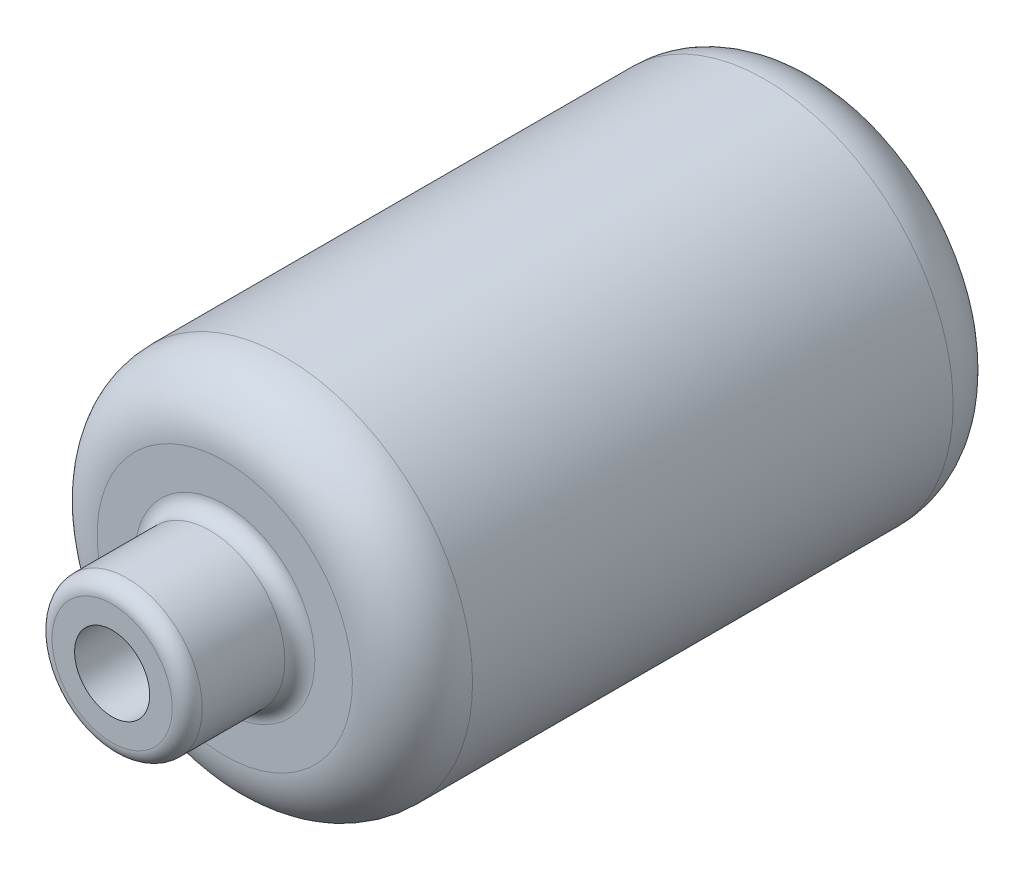
ISO-10303-21;
HEADER;
FILE_DESCRIPTION(('STEP AP214'),'2;1');
FILE_NAME('part.step','',(''),(''),'','','');
FILE_SCHEMA(('AUTOMOTIVE_DESIGN { 1 0 10303 214 1 1 1 1 }'));
ENDSEC;
DATA;
#1=APPLICATION_CONTEXT('core data for automotive mechanical design processes');
#2=APPLICATION_PROTOCOL_DEFINITION('international standard','automotive_design',2000,#1);
#3=PRODUCT_CONTEXT('',#1,'mechanical');
#4=PRODUCT('Part','Part','',(#3));
#5=PRODUCT_RELATED_PRODUCT_CATEGORY('part','',(#4));
#6=PRODUCT_DEFINITION_FORMATION('','',#4);
#7=PRODUCT_DEFINITION_CONTEXT('part definition',#1,'design');
#8=PRODUCT_DEFINITION('design','',#6,#7);
#9=PRODUCT_DEFINITION_SHAPE('','',#8);
#10=(LENGTH_UNIT() NAMED_UNIT(*) SI_UNIT(.MILLI.,.METRE.));
#11=(NAMED_UNIT(*) PLANE_ANGLE_UNIT() SI_UNIT($,.RADIAN.));
#12=(NAMED_UNIT(*) SI_UNIT($,.STERADIAN.) SOLID_ANGLE_UNIT());
#13=UNCERTAINTY_MEASURE_WITH_UNIT(LENGTH_MEASURE(1.E-05),#10,'distance_accuracy_value','');
#14=(GEOMETRIC_REPRESENTATION_CONTEXT(3) GLOBAL_UNCERTAINTY_ASSIGNED_CONTEXT((#13)) GLOBAL_UNIT_ASSIGNED_CONTEXT((#10,
#11,#12)) REPRESENTATION_CONTEXT('',''));
#15=CARTESIAN_POINT('',(0.,0.,0.));
#16=DIRECTION('',(0.,0.,1.));
#17=DIRECTION('',(1.,0.,0.));
#18=AXIS2_PLACEMENT_3D('',#15,#16,#17);
#19=CARTESIAN_POINT('',(0.,0.,80.));
#20=DIRECTION('',(0.,0.,-1.));
#21=DIRECTION('',(-1.,0.,0.));
#22=AXIS2_PLACEMENT_3D('',#19,#20,#21);
#23=CYLINDRICAL_SURFACE('',#22,25.);
#24=CARTESIAN_POINT('',(0.,0.,7.99999999999999));
#25=DIRECTION('',(0.,0.,1.));
#26=DIRECTION('',(1.,0.,0.));
#27=AXIS2_PLACEMENT_3D('',#24,#25,#26);
#28=CIRCLE('',#27,25.);
#29=CARTESIAN_POINT('',(25.,0.,7.99999999999999));
#30=VERTEX_POINT('',#29);
#31=EDGE_CURVE('E58',#30,#30,#28,.T.);
#32=ORIENTED_EDGE('',*,*,#31,.T.);
#33=EDGE_LOOP('',(#32));
#34=FACE_BOUND('',#33,.T.);
#35=CARTESIAN_POINT('',(0.,0.,72.));
#36=DIRECTION('',(0.,0.,1.));
#37=DIRECTION('',(1.,0.,0.));
#38=AXIS2_PLACEMENT_3D('',#35,#36,#37);
#39=CIRCLE('',#38,25.);
#40=CARTESIAN_POINT('',(25.,0.,72.));
#41=VERTEX_POINT('',#40);
#42=EDGE_CURVE('E61',#41,#41,#39,.F.);
#43=ORIENTED_EDGE('',*,*,#42,.T.);
#44=EDGE_LOOP('',(#43));
#45=FACE_BOUND('',#44,.T.);
#46=ADVANCED_FACE('F35',(#34,#45),#23,.T.);
#47=CARTESIAN_POINT('',(0.,0.,80.));
#48=DIRECTION('',(0.,0.,1.));
#49=DIRECTION('',(1.,0.,0.));
#50=AXIS2_PLACEMENT_3D('',#47,#48,#49);
#51=PLANE('',#50);
#52=CARTESIAN_POINT('',(0.,0.,80.));
#53=DIRECTION('',(0.,0.,1.));
#54=DIRECTION('',(1.,0.,0.));
#55=AXIS2_PLACEMENT_3D('',#52,#53,#54);
#56=CIRCLE('',#55,12.);
#57=CARTESIAN_POINT('',(12.,0.,80.));
#58=VERTEX_POINT('',#57);
#59=EDGE_CURVE('E42',#58,#58,#56,.F.);
#60=ORIENTED_EDGE('',*,*,#59,.T.);
#61=EDGE_LOOP('',(#60));
#62=FACE_BOUND('',#61,.T.);
#63=CARTESIAN_POINT('',(0.,0.,80.));
#64=DIRECTION('',(0.,0.,1.));
#65=DIRECTION('',(1.,0.,0.));
#66=AXIS2_PLACEMENT_3D('',#63,#64,#65);
#67=CIRCLE('',#66,17.);
#68=CARTESIAN_POINT('',(17.,0.,80.));
#69=VERTEX_POINT('',#68);
#70=EDGE_CURVE('E64',#69,#69,#67,.T.);
#71=ORIENTED_EDGE('',*,*,#70,.T.);
#72=EDGE_LOOP('',(#71));
#73=FACE_BOUND('',#72,.T.);
#74=ADVANCED_FACE('F100',(#62,#73),#51,.T.);
#75=CARTESIAN_POINT('',(0.,0.,0.));
#76=DIRECTION('',(0.,0.,1.));
#77=DIRECTION('',(1.,0.,0.));
#78=AXIS2_PLACEMENT_3D('',#75,#76,#77);
#79=PLANE('',#78);
#80=CARTESIAN_POINT('',(0.,0.,0.));
#81=DIRECTION('',(0.,0.,1.));
#82=DIRECTION('',(1.,0.,0.));
#83=AXIS2_PLACEMENT_3D('',#80,#81,#82);
#84=CIRCLE('',#83,17.);
#85=CARTESIAN_POINT('',(17.,0.,0.));
#86=VERTEX_POINT('',#85);
#87=EDGE_CURVE('E55',#86,#86,#84,.F.);
#88=ORIENTED_EDGE('',*,*,#87,.T.);
#89=EDGE_LOOP('',(#88));
#90=FACE_BOUND('',#89,.T.);
#91=ADVANCED_FACE('F96',(#90),#79,.F.);
#92=CARTESIAN_POINT('',(0.,0.,95.));
#93=DIRECTION('',(0.,0.,-1.));
#94=DIRECTION('',(-1.,0.,0.));
#95=AXIS2_PLACEMENT_3D('',#92,#93,#94);
#96=CYLINDRICAL_SURFACE('',#95,10.);
#97=CARTESIAN_POINT('',(0.,0.,82.));
#98=DIRECTION('',(0.,0.,1.));
#99=DIRECTION('',(1.,0.,0.));
#100=AXIS2_PLACEMENT_3D('',#97,#98,#99);
#101=CIRCLE('',#100,10.);
#102=CARTESIAN_POINT('',(10.,0.,82.));
#103=VERTEX_POINT('',#102);
#104=EDGE_CURVE('E46',#103,#103,#101,.T.);
#105=ORIENTED_EDGE('',*,*,#104,.T.);
#106=EDGE_LOOP('',(#105));
#107=FACE_BOUND('',#106,.T.);
#108=CARTESIAN_POINT('',(0.,0.,93.));
#109=DIRECTION('',(0.,0.,1.));
#110=DIRECTION('',(1.,0.,0.));
#111=AXIS2_PLACEMENT_3D('',#108,#109,#110);
#112=CIRCLE('',#111,10.);
#113=CARTESIAN_POINT('',(10.,0.,93.));
#114=VERTEX_POINT('',#113);
#115=EDGE_CURVE('E50',#114,#114,#112,.F.);
#116=ORIENTED_EDGE('',*,*,#115,.T.);
#117=EDGE_LOOP('',(#116));
#118=FACE_BOUND('',#117,.T.);
#119=ADVANCED_FACE('F85',(#107,#118),#96,.T.);
#120=CARTESIAN_POINT('',(0.,0.,95.));
#121=DIRECTION('',(0.,0.,1.));
#122=DIRECTION('',(1.,0.,0.));
#123=AXIS2_PLACEMENT_3D('',#120,#121,#122);
#124=PLANE('',#123);
#125=CARTESIAN_POINT('',(0.,0.,95.));
#126=DIRECTION('',(0.,0.,1.));
#127=DIRECTION('',(1.,0.,0.));
#128=AXIS2_PLACEMENT_3D('',#125,#126,#127);
#129=CIRCLE('',#128,5.);
#130=CARTESIAN_POINT('',(5.,0.,95.));
#131=VERTEX_POINT('',#130);
#132=EDGE_CURVE('E68',#131,#131,#129,.T.);
#133=ORIENTED_EDGE('',*,*,#132,.F.);
#134=EDGE_LOOP('',(#133));
#135=FACE_BOUND('',#134,.T.);
#136=CARTESIAN_POINT('',(0.,0.,95.));
#137=DIRECTION('',(0.,0.,1.));
#138=DIRECTION('',(1.,0.,0.));
#139=AXIS2_PLACEMENT_3D('',#136,#137,#138);
#140=CIRCLE('',#139,8.);
#141=CARTESIAN_POINT('',(8.,0.,95.));
#142=VERTEX_POINT('',#141);
#143=EDGE_CURVE('E10',#142,#142,#140,.T.);
#144=ORIENTED_EDGE('',*,*,#143,.T.);
#145=EDGE_LOOP('',(#144));
#146=FACE_BOUND('',#145,.T.);
#147=ADVANCED_FACE('F82',(#135,#146),#124,.T.);
#148=CARTESIAN_POINT('',(0.,0.,72.));
#149=DIRECTION('',(0.,0.,1.));
#150=DIRECTION('',(1.,0.,0.));
#151=AXIS2_PLACEMENT_3D('',#148,#149,#150);
#152=TOROIDAL_SURFACE('',#151,17.,8.);
#153=ORIENTED_EDGE('',*,*,#42,.F.);
#154=EDGE_LOOP('',(#153));
#155=FACE_BOUND('',#154,.T.);
#156=ORIENTED_EDGE('',*,*,#70,.F.);
#157=EDGE_LOOP('',(#156));
#158=FACE_BOUND('',#157,.T.);
#159=ADVANCED_FACE('F84',(#155,#158),#152,.T.);
#160=CARTESIAN_POINT('',(0.,0.,7.99999999999999));
#161=DIRECTION('',(0.,0.,1.));
#162=DIRECTION('',(1.,0.,0.));
#163=AXIS2_PLACEMENT_3D('',#160,#161,#162);
#164=TOROIDAL_SURFACE('',#163,17.,8.);
#165=ORIENTED_EDGE('',*,*,#87,.F.);
#166=EDGE_LOOP('',(#165));
#167=FACE_BOUND('',#166,.T.);
#168=ORIENTED_EDGE('',*,*,#31,.F.);
#169=EDGE_LOOP('',(#168));
#170=FACE_BOUND('',#169,.T.);
#171=ADVANCED_FACE('F92',(#167,#170),#164,.T.);
#172=CARTESIAN_POINT('',(0.,0.,82.));
#173=DIRECTION('',(0.,0.,1.));
#174=DIRECTION('',(1.,0.,0.));
#175=AXIS2_PLACEMENT_3D('',#172,#173,#174);
#176=TOROIDAL_SURFACE('',#175,12.,2.);
#177=ORIENTED_EDGE('',*,*,#59,.F.);
#178=EDGE_LOOP('',(#177));
#179=FACE_BOUND('',#178,.T.);
#180=ORIENTED_EDGE('',*,*,#104,.F.);
#181=EDGE_LOOP('',(#180));
#182=FACE_BOUND('',#181,.T.);
#183=ADVANCED_FACE('F111',(#179,#182),#176,.F.);
#184=CARTESIAN_POINT('',(0.,0.,93.));
#185=DIRECTION('',(0.,0.,1.));
#186=DIRECTION('',(1.,0.,0.));
#187=AXIS2_PLACEMENT_3D('',#184,#185,#186);
#188=TOROIDAL_SURFACE('',#187,8.,2.);
#189=ORIENTED_EDGE('',*,*,#115,.F.);
#190=EDGE_LOOP('',(#189));
#191=FACE_BOUND('',#190,.T.);
#192=ORIENTED_EDGE('',*,*,#143,.F.);
#193=EDGE_LOOP('',(#192));
#194=FACE_BOUND('',#193,.T.);
#195=ADVANCED_FACE('F37',(#191,#194),#188,.T.);
#196=CARTESIAN_POINT('',(0.,0.,69.));
#197=DIRECTION('',(0.,0.,1.));
#198=DIRECTION('',(1.,0.,0.));
#199=AXIS2_PLACEMENT_3D('',#196,#197,#198);
#200=CYLINDRICAL_SURFACE('',#199,5.);
#201=CARTESIAN_POINT('',(0.,0.,69.));
#202=DIRECTION('',(0.,0.,1.));
#203=DIRECTION('',(1.,0.,0.));
#204=AXIS2_PLACEMENT_3D('',#201,#202,#203);
#205=CIRCLE('',#204,5.);
#206=CARTESIAN_POINT('',(5.,0.,69.));
#207=VERTEX_POINT('',#206);
#208=EDGE_CURVE('E67',#207,#207,#205,.T.);
#209=ORIENTED_EDGE('',*,*,#208,.F.);
#210=EDGE_LOOP('',(#209));
#211=FACE_BOUND('',#210,.T.);
#212=ORIENTED_EDGE('',*,*,#132,.T.);
#213=EDGE_LOOP('',(#212));
#214=FACE_BOUND('',#213,.T.);
#215=ADVANCED_FACE('F76',(#211,#214),#200,.F.);
#216=CARTESIAN_POINT('',(0.,0.,69.));
#217=DIRECTION('',(0.,0.,1.));
#218=DIRECTION('',(1.,0.,0.));
#219=AXIS2_PLACEMENT_3D('',#216,#217,#218);
#220=PLANE('',#219);
#221=ORIENTED_EDGE('',*,*,#208,.T.);
#222=EDGE_LOOP('',(#221));
#223=FACE_BOUND('',#222,.T.);
#224=ADVANCED_FACE('F74',(#223),#220,.T.);
#225=CLOSED_SHELL('',(#46,#74,#91,#119,#147,#159,#171,#183,#195,#215,#224));
#226=MANIFOLD_SOLID_BREP('B2',#225);
#227=ADVANCED_BREP_SHAPE_REPRESENTATION('',(#18,#226),#14);
#228=SHAPE_DEFINITION_REPRESENTATION(#9,#227);
ENDSEC;
END-ISO-10303-21;
